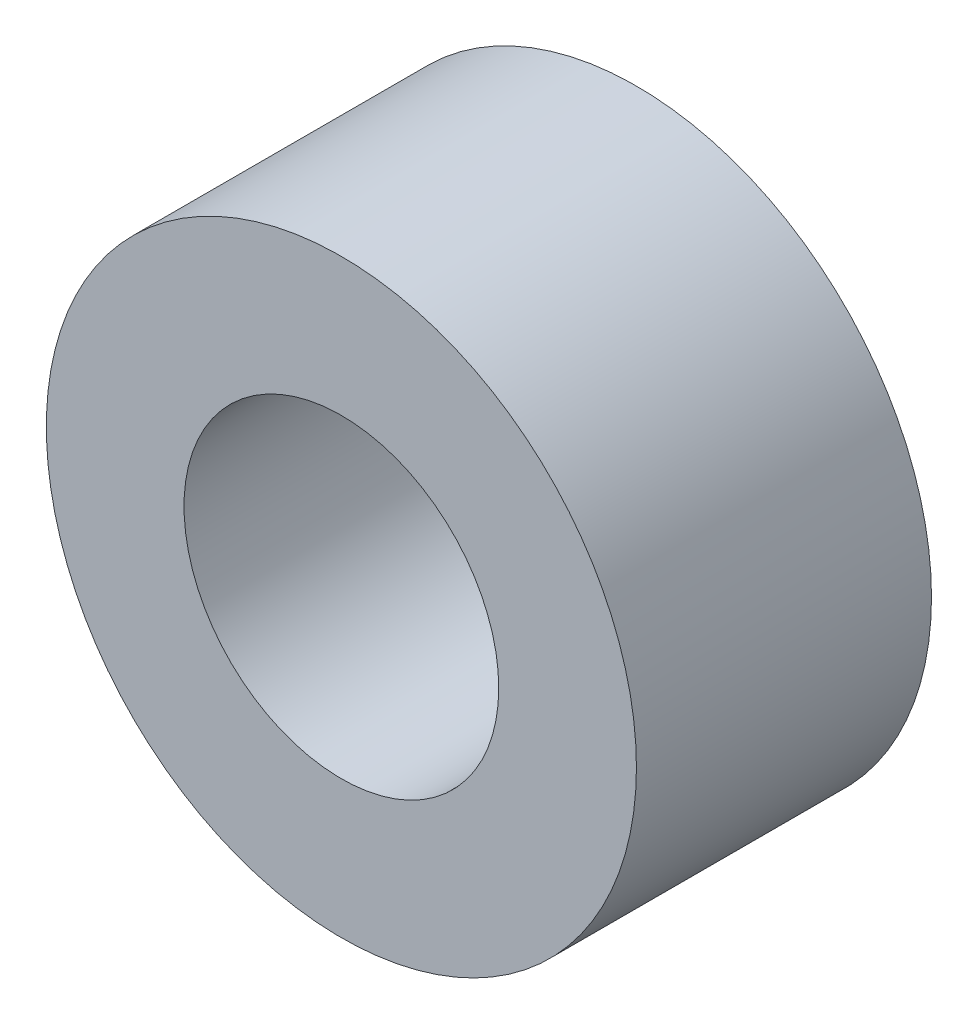
ISO-10303-21;
HEADER;
FILE_DESCRIPTION(('STEP AP214'),'2;1');
FILE_NAME('part.step','',(''),(''),'','','');
FILE_SCHEMA(('AUTOMOTIVE_DESIGN { 1 0 10303 214 1 1 1 1 }'));
ENDSEC;
DATA;
#1=APPLICATION_CONTEXT('core data for automotive mechanical design processes');
#2=APPLICATION_PROTOCOL_DEFINITION('international standard','automotive_design',2000,#1);
#3=PRODUCT_CONTEXT('',#1,'mechanical');
#4=PRODUCT('Part','Part','',(#3));
#5=PRODUCT_RELATED_PRODUCT_CATEGORY('part','',(#4));
#6=PRODUCT_DEFINITION_FORMATION('','',#4);
#7=PRODUCT_DEFINITION_CONTEXT('part definition',#1,'design');
#8=PRODUCT_DEFINITION('design','',#6,#7);
#9=PRODUCT_DEFINITION_SHAPE('','',#8);
#10=(LENGTH_UNIT() NAMED_UNIT(*) SI_UNIT(.MILLI.,.METRE.));
#11=(NAMED_UNIT(*) PLANE_ANGLE_UNIT() SI_UNIT($,.RADIAN.));
#12=(NAMED_UNIT(*) SI_UNIT($,.STERADIAN.) SOLID_ANGLE_UNIT());
#13=UNCERTAINTY_MEASURE_WITH_UNIT(LENGTH_MEASURE(1.E-05),#10,'distance_accuracy_value','');
#14=(GEOMETRIC_REPRESENTATION_CONTEXT(3) GLOBAL_UNCERTAINTY_ASSIGNED_CONTEXT((#13)) GLOBAL_UNIT_ASSIGNED_CONTEXT((#10,
#11,#12)) REPRESENTATION_CONTEXT('',''));
#15=CARTESIAN_POINT('',(0.,0.,0.));
#16=DIRECTION('',(0.,0.,1.));
#17=DIRECTION('',(1.,0.,0.));
#18=AXIS2_PLACEMENT_3D('',#15,#16,#17);
#19=CARTESIAN_POINT('',(0.,0.,1.5));
#20=DIRECTION('',(0.,0.,1.));
#21=DIRECTION('',(1.,0.,0.));
#22=AXIS2_PLACEMENT_3D('',#19,#20,#21);
#23=PLANE('',#22);
#24=CARTESIAN_POINT('',(0.,0.,1.5));
#25=DIRECTION('',(0.,0.,1.));
#26=DIRECTION('',(1.,0.,0.));
#27=AXIS2_PLACEMENT_3D('',#24,#25,#26);
#28=CIRCLE('',#27,3.);
#29=CARTESIAN_POINT('',(3.,0.,1.5));
#30=VERTEX_POINT('',#29);
#31=EDGE_CURVE('E10',#30,#30,#28,.T.);
#32=ORIENTED_EDGE('',*,*,#31,.T.);
#33=EDGE_LOOP('',(#32));
#34=FACE_BOUND('',#33,.T.);
#35=CARTESIAN_POINT('',(0.,0.,1.5));
#36=DIRECTION('',(0.,0.,1.));
#37=DIRECTION('',(1.,0.,0.));
#38=AXIS2_PLACEMENT_3D('',#35,#36,#37);
#39=CIRCLE('',#38,1.6);
#40=CARTESIAN_POINT('',(1.6,0.,1.5));
#41=VERTEX_POINT('',#40);
#42=EDGE_CURVE('E37',#41,#41,#39,.T.);
#43=ORIENTED_EDGE('',*,*,#42,.F.);
#44=EDGE_LOOP('',(#43));
#45=FACE_BOUND('',#44,.T.);
#46=ADVANCED_FACE('F30',(#34,#45),#23,.T.);
#47=CARTESIAN_POINT('',(0.,0.,1.5));
#48=DIRECTION('',(0.,0.,-1.));
#49=DIRECTION('',(-1.,0.,0.));
#50=AXIS2_PLACEMENT_3D('',#47,#48,#49);
#51=CYLINDRICAL_SURFACE('',#50,3.);
#52=ORIENTED_EDGE('',*,*,#31,.F.);
#53=EDGE_LOOP('',(#52));
#54=FACE_BOUND('',#53,.T.);
#55=CARTESIAN_POINT('',(0.,0.,-1.5));
#56=DIRECTION('',(0.,0.,1.));
#57=DIRECTION('',(1.,0.,0.));
#58=AXIS2_PLACEMENT_3D('',#55,#56,#57);
#59=CIRCLE('',#58,3.);
#60=CARTESIAN_POINT('',(3.,0.,-1.5));
#61=VERTEX_POINT('',#60);
#62=EDGE_CURVE('E41',#61,#61,#59,.T.);
#63=ORIENTED_EDGE('',*,*,#62,.T.);
#64=EDGE_LOOP('',(#63));
#65=FACE_BOUND('',#64,.T.);
#66=ADVANCED_FACE('F32',(#54,#65),#51,.T.);
#67=CARTESIAN_POINT('',(0.,0.,1.5));
#68=DIRECTION('',(0.,0.,-1.));
#69=DIRECTION('',(-1.,0.,0.));
#70=AXIS2_PLACEMENT_3D('',#67,#68,#69);
#71=CYLINDRICAL_SURFACE('',#70,1.6);
#72=ORIENTED_EDGE('',*,*,#42,.T.);
#73=EDGE_LOOP('',(#72));
#74=FACE_BOUND('',#73,.T.);
#75=CARTESIAN_POINT('',(0.,0.,-1.5));
#76=DIRECTION('',(0.,0.,1.));
#77=DIRECTION('',(1.,0.,0.));
#78=AXIS2_PLACEMENT_3D('',#75,#76,#77);
#79=CIRCLE('',#78,1.6);
#80=CARTESIAN_POINT('',(1.6,0.,-1.5));
#81=VERTEX_POINT('',#80);
#82=EDGE_CURVE('E45',#81,#81,#79,.T.);
#83=ORIENTED_EDGE('',*,*,#82,.F.);
#84=EDGE_LOOP('',(#83));
#85=FACE_BOUND('',#84,.T.);
#86=ADVANCED_FACE('F54',(#74,#85),#71,.F.);
#87=CARTESIAN_POINT('',(0.,0.,-1.5));
#88=DIRECTION('',(0.,0.,1.));
#89=DIRECTION('',(1.,0.,0.));
#90=AXIS2_PLACEMENT_3D('',#87,#88,#89);
#91=PLANE('',#90);
#92=ORIENTED_EDGE('',*,*,#82,.T.);
#93=EDGE_LOOP('',(#92));
#94=FACE_BOUND('',#93,.T.);
#95=ORIENTED_EDGE('',*,*,#62,.F.);
#96=EDGE_LOOP('',(#95));
#97=FACE_BOUND('',#96,.T.);
#98=ADVANCED_FACE('F51',(#94,#97),#91,.F.);
#99=CLOSED_SHELL('',(#46,#66,#86,#98));
#100=MANIFOLD_SOLID_BREP('B2',#99);
#101=ADVANCED_BREP_SHAPE_REPRESENTATION('',(#18,#100),#14);
#102=SHAPE_DEFINITION_REPRESENTATION(#9,#101);
ENDSEC;
END-ISO-10303-21;
